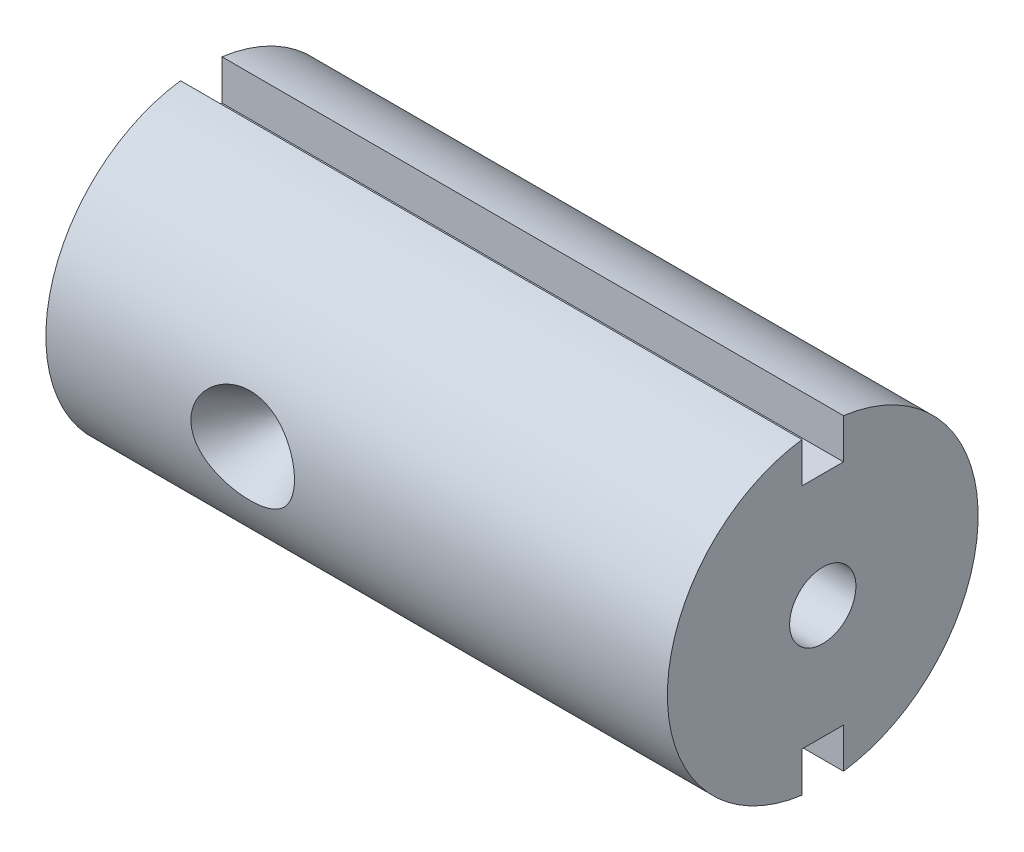
ISO-10303-21;
HEADER;
FILE_DESCRIPTION(('STEP AP214'),'2;1');
FILE_NAME('part.step','',(''),(''),'','','');
FILE_SCHEMA(('AUTOMOTIVE_DESIGN { 1 0 10303 214 1 1 1 1 }'));
ENDSEC;
DATA;
#1=APPLICATION_CONTEXT('core data for automotive mechanical design processes');
#2=APPLICATION_PROTOCOL_DEFINITION('international standard','automotive_design',2000,#1);
#3=PRODUCT_CONTEXT('',#1,'mechanical');
#4=PRODUCT('Part','Part','',(#3));
#5=PRODUCT_RELATED_PRODUCT_CATEGORY('part','',(#4));
#6=PRODUCT_DEFINITION_FORMATION('','',#4);
#7=PRODUCT_DEFINITION_CONTEXT('part definition',#1,'design');
#8=PRODUCT_DEFINITION('design','',#6,#7);
#9=PRODUCT_DEFINITION_SHAPE('','',#8);
#10=(LENGTH_UNIT() NAMED_UNIT(*) SI_UNIT(.MILLI.,.METRE.));
#11=(NAMED_UNIT(*) PLANE_ANGLE_UNIT() SI_UNIT($,.RADIAN.));
#12=(NAMED_UNIT(*) SI_UNIT($,.STERADIAN.) SOLID_ANGLE_UNIT());
#13=UNCERTAINTY_MEASURE_WITH_UNIT(LENGTH_MEASURE(1.E-05),#10,'distance_accuracy_value','');
#14=(GEOMETRIC_REPRESENTATION_CONTEXT(3) GLOBAL_UNCERTAINTY_ASSIGNED_CONTEXT((#13)) GLOBAL_UNIT_ASSIGNED_CONTEXT((#10,
#11,#12)) REPRESENTATION_CONTEXT('',''));
#15=CARTESIAN_POINT('',(0.,0.,0.));
#16=DIRECTION('',(0.,0.,1.));
#17=DIRECTION('',(1.,0.,0.));
#18=AXIS2_PLACEMENT_3D('',#15,#16,#17);
#19=CARTESIAN_POINT('',(30.,0.,0.));
#20=DIRECTION('',(-1.,0.,0.));
#21=DIRECTION('',(0.,0.,1.));
#22=AXIS2_PLACEMENT_3D('',#19,#20,#21);
#23=CYLINDRICAL_SURFACE('',#22,7.5);
#24=CARTESIAN_POINT('',(8.05167576643388,-1.8678339095159,7.2636903168473));
#25=CARTESIAN_POINT('',(7.94089384267672,-1.79551979116087,7.28228452229218));
#26=CARTESIAN_POINT('',(7.83594834377855,-1.71454184921139,7.3019635860243));
#27=CARTESIAN_POINT('',(7.64064186116554,-1.53652103246427,7.34148512460798));
#28=CARTESIAN_POINT('',(7.55028270935543,-1.43947614290813,7.36132761965653));
#29=CARTESIAN_POINT('',(7.38387524010526,-1.22677443180059,7.39980801053964));
#30=CARTESIAN_POINT('',(7.30857195987766,-1.11051452676328,7.41836232759838));
#31=CARTESIAN_POINT('',(7.18073046184307,-0.865486083990146,7.45091545237177));
#32=CARTESIAN_POINT('',(7.12817620389597,-0.736726438395548,7.46491746813526));
#33=CARTESIAN_POINT('',(7.05285690116359,-0.484404625545233,7.48530052112564));
#34=CARTESIAN_POINT('',(7.02761908946084,-0.361631166386663,7.49230848320894));
#35=CARTESIAN_POINT('',(6.99935923763121,-0.113383751305522,7.50016832600957));
#36=CARTESIAN_POINT('',(6.99632372639625,0.0120885207662788,7.50102393962085));
#37=CARTESIAN_POINT('',(7.01193598553265,0.251181951463353,7.49666877916093));
#38=CARTESIAN_POINT('',(7.0288279924378,0.364931988878639,7.49194917688945));
#39=CARTESIAN_POINT('',(7.08062380974595,0.58792444391891,7.47775571735527));
#40=CARTESIAN_POINT('',(7.11552826539031,0.697166699914885,7.46828168978003));
#41=CARTESIAN_POINT('',(7.20240916959938,0.909807532075697,7.44539110102609));
#42=CARTESIAN_POINT('',(7.25459951137338,1.01311282794113,7.43192537826443));
#43=CARTESIAN_POINT('',(7.37398000201785,1.21022391244733,7.40238531524525));
#44=CARTESIAN_POINT('',(7.44117492959094,1.30402666082396,7.3863101443697));
#45=CARTESIAN_POINT('',(7.59509516254294,1.48845167918439,7.35146887044087));
#46=CARTESIAN_POINT('',(7.68302787117252,1.57804405578019,7.33259063916497));
#47=CARTESIAN_POINT('',(7.87166623642185,1.74267846479196,7.2952185595908));
#48=CARTESIAN_POINT('',(7.97237762536778,1.81771392875271,7.27672488816062));
#49=CARTESIAN_POINT('',(8.19445831061447,1.95873731062884,7.2401089630666));
#50=CARTESIAN_POINT('',(8.31688475368407,2.02312038196357,7.22220030887429));
#51=CARTESIAN_POINT('',(8.57084608930949,2.13191681110655,7.19083774467195));
#52=CARTESIAN_POINT('',(8.7023829550377,2.1763258271467,7.17738480336931));
#53=CARTESIAN_POINT('',(8.97743968468817,2.24591331074875,7.15592624277002));
#54=CARTESIAN_POINT('',(9.12123238558421,2.27010601894585,7.14820172669417));
#55=CARTESIAN_POINT('',(9.41103637247809,2.29515403183163,7.14019918694196));
#56=CARTESIAN_POINT('',(9.55704766550141,2.29600926260355,7.13992118685094));
#57=CARTESIAN_POINT('',(9.84729204256608,2.27435549490544,7.14684772622238));
#58=CARTESIAN_POINT('',(9.99152323160554,2.25182346145707,7.15405964278375));
#59=CARTESIAN_POINT('',(10.2740005824609,2.18386501275763,7.17509482599233));
#60=CARTESIAN_POINT('',(10.4122459392935,2.13843552854429,7.1889189788698));
#61=CARTESIAN_POINT('',(10.6791039323375,2.02550924289219,7.22154818550873));
#62=CARTESIAN_POINT('',(10.8076975501141,1.95797020955479,7.24036275841835));
#63=CARTESIAN_POINT('',(11.0511945289785,1.80210416414523,7.28071986992329));
#64=CARTESIAN_POINT('',(11.1660961235601,1.71377447408558,7.30226275978036));
#65=CARTESIAN_POINT('',(11.376720508024,1.51950300546134,7.34512334142966));
#66=CARTESIAN_POINT('',(11.4727086012374,1.41384976851686,7.36643946984713));
#67=CARTESIAN_POINT('',(11.6437558639087,1.18631512488658,7.40647976096864));
#68=CARTESIAN_POINT('',(11.7188286311231,1.06444433829816,7.42520560369803));
#69=CARTESIAN_POINT('',(11.8390792187722,0.818457685144129,7.45615166506275));
#70=CARTESIAN_POINT('',(11.8862071316719,0.695349803365731,7.46878011506183));
#71=CARTESIAN_POINT('',(11.9570715670546,0.442148625658909,7.4880276141246));
#72=CARTESIAN_POINT('',(11.9808288878273,0.312061649605022,7.49465200599139));
#73=CARTESIAN_POINT('',(12.002354764927,0.0634048661109276,7.50065416285993));
#74=CARTESIAN_POINT('',(12.0025898586507,-0.0549403047615223,7.50071968982459));
#75=CARTESIAN_POINT('',(11.9832144135466,-0.28984888948782,7.49531713380502));
#76=CARTESIAN_POINT('',(11.9636072482175,-0.406412602798082,7.48984999146237));
#77=CARTESIAN_POINT('',(11.9064622917801,-0.630707021684352,7.4742535387995));
#78=CARTESIAN_POINT('',(11.8695151895755,-0.7386007922798,7.46427818837703));
#79=CARTESIAN_POINT('',(11.7794930391153,-0.94698639708331,7.44071412409292));
#80=CARTESIAN_POINT('',(11.7264147155406,-1.04747672292655,7.42712467648702));
#81=CARTESIAN_POINT('',(11.6022183464845,-1.24509275286741,7.39664553195232));
#82=CARTESIAN_POINT('',(11.5301790383081,-1.34161406592102,7.37960249638282));
#83=CARTESIAN_POINT('',(11.372324159744,-1.52240502772114,7.34443888656984));
#84=CARTESIAN_POINT('',(11.2865026901591,-1.60666940054624,7.32631785300985));
#85=CARTESIAN_POINT('',(11.0938852956575,-1.76972984723335,7.28874279140795));
#86=CARTESIAN_POINT('',(10.9858386595661,-1.84706298687837,7.26934431491299));
#87=CARTESIAN_POINT('',(10.7586851111909,-1.98408952092731,7.23314755617545));
#88=CARTESIAN_POINT('',(10.6395742434166,-2.04377657466728,7.21635020961148));
#89=CARTESIAN_POINT('',(10.3841771657892,-2.14823217307837,7.18597878097804));
#90=CARTESIAN_POINT('',(10.2472719470952,-2.19158872302593,7.17273068026494));
#91=CARTESIAN_POINT('',(9.96785105658163,-2.25596853847842,7.15274433593004));
#92=CARTESIAN_POINT('',(9.82533506405638,-2.27699052543662,7.1460064649897));
#93=CARTESIAN_POINT('',(9.53644227558881,-2.29638299613897,7.13979959879468));
#94=CARTESIAN_POINT('',(9.39003966409248,-2.29440731148271,7.14044168726841));
#95=CARTESIAN_POINT('',(9.09966976228018,-2.26700548189143,7.14918788554491));
#96=CARTESIAN_POINT('',(8.95570252058019,-2.24157886937943,7.15729214413235));
#97=CARTESIAN_POINT('',(8.67940692503231,-2.16919786502499,7.17955032474397));
#98=CARTESIAN_POINT('',(8.54684583495133,-2.12305743289408,7.19347424995065));
#99=CARTESIAN_POINT('',(8.29126242241162,-2.01041738691509,7.2257624124832));
#100=CARTESIAN_POINT('',(8.16823838647997,-1.94392144091013,7.24412584973187));
#101=CARTESIAN_POINT('',(8.05167576643388,-1.8678339095159,7.2636903168473));
#102=B_SPLINE_CURVE_WITH_KNOTS('',3,(#24,#25,#26,#27,#28,#29,#30,#31,#32,#33,#34,#35,#36,#37,
#38,#39,#40,#41,#42,#43,#44,#45,#46,#47,#48,#49,#50,#51,#52,#53,#54,#55,#56,#57,#58,#59,#60,#61,
#62,#63,#64,#65,#66,#67,#68,#69,#70,#71,#72,#73,#74,#75,#76,#77,#78,#79,#80,#81,#82,#83,#84,#85,
#86,#87,#88,#89,#90,#91,#92,#93,#94,#95,#96,#97,#98,#99,#100,#101),.UNSPECIFIED.,.T.,.F.,(4,2,2,
2,2,2,2,2,2,2,2,2,2,2,2,2,2,2,2,2,2,2,2,2,2,2,2,2,2,2,2,2,2,2,2,2,2,2,4),(0.,0.400348830519514,
0.800747901944159,1.21768115735281,1.6343199559458,2.00887470738987,2.38320218119541,
2.72686757518835,3.0705452808068,3.41864522871087,3.76685619898675,4.14612479038364,
4.52556412154486,4.94214930326349,5.35882499455208,5.79479608699597,6.23076856029051,
6.66717084678287,7.10363164015684,7.54093103875108,7.97828679553669,8.4089854763123,
8.83940348847229,9.23444156875169,9.62912777222159,9.98237866042114,10.335569500453,
10.6775165798378,11.0195331353552,11.3829592463261,11.7465413317294,12.1476636925128,
12.5489300115362,12.979571438792,13.4102375168783,13.8473943995312,14.2845599986374,
14.7058752480843,15.1271146257289),.UNSPECIFIED.);
#103=CARTESIAN_POINT('',(8.05167576643388,-1.8678339095159,7.2636903168473));
#104=VERTEX_POINT('',#103);
#105=EDGE_CURVE('E169',#104,#104,#102,.T.);
#106=ORIENTED_EDGE('',*,*,#105,.T.);
#107=EDGE_LOOP('',(#106));
#108=FACE_BOUND('',#107,.T.);
#109=CARTESIAN_POINT('',(0.,0.,0.));
#110=DIRECTION('',(1.,0.,0.));
#111=DIRECTION('',(0.,0.,-1.));
#112=AXIS2_PLACEMENT_3D('',#109,#110,#111);
#113=CIRCLE('',#112,7.5);
#114=CARTESIAN_POINT('',(0.,7.43303437365926,0.999999999999948));
#115=VERTEX_POINT('',#114);
#116=CARTESIAN_POINT('',(0.,-7.43303437365925,1.));
#117=VERTEX_POINT('',#116);
#118=EDGE_CURVE('E166',#115,#117,#113,.T.);
#119=ORIENTED_EDGE('',*,*,#118,.T.);
#120=DIRECTION('',(-1.,0.,0.));
#121=VECTOR('',#120,1.);
#122=CARTESIAN_POINT('',(30.,-7.43303437365925,1.));
#123=LINE('',#122,#121);
#124=CARTESIAN_POINT('',(30.,-7.43303437365925,1.));
#125=VERTEX_POINT('',#124);
#126=EDGE_CURVE('E116',#117,#125,#123,.F.);
#127=ORIENTED_EDGE('',*,*,#126,.T.);
#128=CARTESIAN_POINT('',(30.,0.,0.));
#129=DIRECTION('',(1.,0.,0.));
#130=DIRECTION('',(0.,0.,-1.));
#131=AXIS2_PLACEMENT_3D('',#128,#129,#130);
#132=CIRCLE('',#131,7.5);
#133=CARTESIAN_POINT('',(30.,7.43303437365926,0.999999999999948));
#134=VERTEX_POINT('',#133);
#135=EDGE_CURVE('E165',#134,#125,#132,.T.);
#136=ORIENTED_EDGE('',*,*,#135,.F.);
#137=DIRECTION('',(-1.,0.,0.));
#138=VECTOR('',#137,1.);
#139=CARTESIAN_POINT('',(30.,7.43303437365926,0.999999999999948));
#140=LINE('',#139,#138);
#141=EDGE_CURVE('E109',#134,#115,#140,.T.);
#142=ORIENTED_EDGE('',*,*,#141,.T.);
#143=EDGE_LOOP('',(#119,#127,#136,#142));
#144=FACE_BOUND('',#143,.T.);
#145=ADVANCED_FACE('F33',(#108,#144),#23,.T.);
#146=CARTESIAN_POINT('',(30.,-7.43303437365925,-1.));
#147=VERTEX_POINT('',#146);
#148=CARTESIAN_POINT('',(30.,7.43303437365925,-1.00000000000005));
#149=VERTEX_POINT('',#148);
#150=EDGE_CURVE('E162',#147,#149,#132,.T.);
#151=ORIENTED_EDGE('',*,*,#150,.F.);
#152=DIRECTION('',(-1.,0.,0.));
#153=VECTOR('',#152,1.);
#154=CARTESIAN_POINT('',(30.,-7.43303437365925,-1.));
#155=LINE('',#154,#153);
#156=CARTESIAN_POINT('',(0.,-7.43303437365925,-1.));
#157=VERTEX_POINT('',#156);
#158=EDGE_CURVE('E151',#147,#157,#155,.T.);
#159=ORIENTED_EDGE('',*,*,#158,.T.);
#160=CARTESIAN_POINT('',(0.,7.43303437365925,-1.00000000000005));
#161=VERTEX_POINT('',#160);
#162=EDGE_CURVE('E159',#157,#161,#113,.T.);
#163=ORIENTED_EDGE('',*,*,#162,.T.);
#164=DIRECTION('',(-1.,0.,0.));
#165=VECTOR('',#164,1.);
#166=CARTESIAN_POINT('',(30.,7.43303437365925,-1.00000000000005));
#167=LINE('',#166,#165);
#168=EDGE_CURVE('E148',#161,#149,#167,.F.);
#169=ORIENTED_EDGE('',*,*,#168,.T.);
#170=EDGE_LOOP('',(#151,#159,#163,#169));
#171=FACE_BOUND('',#170,.T.);
#172=ADVANCED_FACE('F35',(#171),#23,.T.);
#173=CARTESIAN_POINT('',(30.,0.,0.));
#174=DIRECTION('',(1.,0.,0.));
#175=DIRECTION('',(0.,0.,-1.));
#176=AXIS2_PLACEMENT_3D('',#173,#174,#175);
#177=PLANE('',#176);
#178=DIRECTION('',(0.,-1.,0.));
#179=VECTOR('',#178,1.);
#180=CARTESIAN_POINT('',(30.,-8.18618350013699,1.));
#181=LINE('',#180,#179);
#182=CARTESIAN_POINT('',(30.,-5.5,1.));
#183=VERTEX_POINT('',#182);
#184=EDGE_CURVE('E126',#183,#125,#181,.T.);
#185=ORIENTED_EDGE('',*,*,#184,.F.);
#186=DIRECTION('',(0.,0.,1.));
#187=VECTOR('',#186,1.);
#188=CARTESIAN_POINT('',(30.,-5.5,1.));
#189=LINE('',#188,#187);
#190=CARTESIAN_POINT('',(30.,-5.5,-1.));
#191=VERTEX_POINT('',#190);
#192=EDGE_CURVE('E106',#191,#183,#189,.T.);
#193=ORIENTED_EDGE('',*,*,#192,.F.);
#194=DIRECTION('',(0.,1.,0.));
#195=VECTOR('',#194,1.);
#196=CARTESIAN_POINT('',(30.,-8.18618350013699,-1.));
#197=LINE('',#196,#195);
#198=EDGE_CURVE('E128',#147,#191,#197,.T.);
#199=ORIENTED_EDGE('',*,*,#198,.F.);
#200=ORIENTED_EDGE('',*,*,#150,.T.);
#201=DIRECTION('',(0.,1.,0.));
#202=VECTOR('',#201,1.);
#203=CARTESIAN_POINT('',(30.,8.18618350013698,-1.00000000000006));
#204=LINE('',#203,#202);
#205=CARTESIAN_POINT('',(30.,5.49999999999999,-1.00000000000004));
#206=VERTEX_POINT('',#205);
#207=EDGE_CURVE('E134',#206,#149,#204,.T.);
#208=ORIENTED_EDGE('',*,*,#207,.F.);
#209=DIRECTION('',(0.,0.,-1.));
#210=VECTOR('',#209,1.);
#211=CARTESIAN_POINT('',(30.,5.49999999999999,-1.00000000000004));
#212=LINE('',#211,#210);
#213=CARTESIAN_POINT('',(30.,5.50000000000001,0.999999999999961));
#214=VERTEX_POINT('',#213);
#215=EDGE_CURVE('E140',#214,#206,#212,.T.);
#216=ORIENTED_EDGE('',*,*,#215,.F.);
#217=DIRECTION('',(0.,-1.,0.));
#218=VECTOR('',#217,1.);
#219=CARTESIAN_POINT('',(30.,8.18618350013699,0.999999999999942));
#220=LINE('',#219,#218);
#221=EDGE_CURVE('E138',#134,#214,#220,.T.);
#222=ORIENTED_EDGE('',*,*,#221,.F.);
#223=ORIENTED_EDGE('',*,*,#135,.T.);
#224=EDGE_LOOP('',(#185,#193,#199,#200,#208,#216,#222,#223));
#225=FACE_BOUND('',#224,.T.);
#226=CARTESIAN_POINT('',(30.,0.,0.));
#227=DIRECTION('',(-1.,0.,0.));
#228=DIRECTION('',(0.,0.,1.));
#229=AXIS2_PLACEMENT_3D('',#226,#227,#228);
#230=CIRCLE('',#229,1.6);
#231=CARTESIAN_POINT('',(30.,0.,1.6));
#232=VERTEX_POINT('',#231);
#233=EDGE_CURVE('E156',#232,#232,#230,.T.);
#234=ORIENTED_EDGE('',*,*,#233,.T.);
#235=EDGE_LOOP('',(#234));
#236=FACE_BOUND('',#235,.T.);
#237=ADVANCED_FACE('F182',(#225,#236),#177,.T.);
#238=CARTESIAN_POINT('',(0.,0.,0.));
#239=DIRECTION('',(1.,0.,0.));
#240=DIRECTION('',(0.,0.,-1.));
#241=AXIS2_PLACEMENT_3D('',#238,#239,#240);
#242=PLANE('',#241);
#243=CARTESIAN_POINT('',(0.,0.,0.));
#244=DIRECTION('',(-1.,0.,0.));
#245=DIRECTION('',(0.,0.,1.));
#246=AXIS2_PLACEMENT_3D('',#243,#244,#245);
#247=CIRCLE('',#246,1.6);
#248=CARTESIAN_POINT('',(0.,0.,1.6));
#249=VERTEX_POINT('',#248);
#250=EDGE_CURVE('E155',#249,#249,#247,.T.);
#251=ORIENTED_EDGE('',*,*,#250,.F.);
#252=EDGE_LOOP('',(#251));
#253=FACE_BOUND('',#252,.T.);
#254=DIRECTION('',(0.,0.,1.));
#255=VECTOR('',#254,1.);
#256=CARTESIAN_POINT('',(0.,-5.5,1.));
#257=LINE('',#256,#255);
#258=CARTESIAN_POINT('',(0.,-5.5,-1.));
#259=VERTEX_POINT('',#258);
#260=CARTESIAN_POINT('',(0.,-5.5,1.));
#261=VERTEX_POINT('',#260);
#262=EDGE_CURVE('E49',#259,#261,#257,.T.);
#263=ORIENTED_EDGE('',*,*,#262,.T.);
#264=DIRECTION('',(0.,-1.,0.));
#265=VECTOR('',#264,1.);
#266=CARTESIAN_POINT('',(0.,-8.18618350013699,1.));
#267=LINE('',#266,#265);
#268=EDGE_CURVE('E113',#261,#117,#267,.T.);
#269=ORIENTED_EDGE('',*,*,#268,.T.);
#270=ORIENTED_EDGE('',*,*,#118,.F.);
#271=DIRECTION('',(0.,-1.,0.));
#272=VECTOR('',#271,1.);
#273=CARTESIAN_POINT('',(0.,0.,1.));
#274=LINE('',#273,#272);
#275=CARTESIAN_POINT('',(0.,5.50000000000001,0.999999999999961));
#276=VERTEX_POINT('',#275);
#277=EDGE_CURVE('E42',#115,#276,#274,.T.);
#278=ORIENTED_EDGE('',*,*,#277,.T.);
#279=DIRECTION('',(0.,0.,-1.));
#280=VECTOR('',#279,1.);
#281=CARTESIAN_POINT('',(0.,5.49999999999999,-1.00000000000004));
#282=LINE('',#281,#280);
#283=CARTESIAN_POINT('',(0.,5.49999999999999,-1.00000000000004));
#284=VERTEX_POINT('',#283);
#285=EDGE_CURVE('E57',#276,#284,#282,.T.);
#286=ORIENTED_EDGE('',*,*,#285,.T.);
#287=DIRECTION('',(0.,1.,0.));
#288=VECTOR('',#287,1.);
#289=CARTESIAN_POINT('',(0.,8.18618350013698,-1.00000000000006));
#290=LINE('',#289,#288);
#291=EDGE_CURVE('E133',#284,#161,#290,.T.);
#292=ORIENTED_EDGE('',*,*,#291,.T.);
#293=ORIENTED_EDGE('',*,*,#162,.F.);
#294=DIRECTION('',(0.,1.,0.));
#295=VECTOR('',#294,1.);
#296=CARTESIAN_POINT('',(0.,0.,-1.));
#297=LINE('',#296,#295);
#298=EDGE_CURVE('E11',#157,#259,#297,.T.);
#299=ORIENTED_EDGE('',*,*,#298,.T.);
#300=EDGE_LOOP('',(#263,#269,#270,#278,#286,#292,#293,#299));
#301=FACE_BOUND('',#300,.T.);
#302=ADVANCED_FACE('F121',(#253,#301),#242,.F.);
#303=CARTESIAN_POINT('',(9.5,0.,7.5));
#304=DIRECTION('',(0.,0.,1.));
#305=DIRECTION('',(1.,0.,0.));
#306=AXIS2_PLACEMENT_3D('',#303,#304,#305);
#307=CONICAL_SURFACE('',#306,2.5,0.523598775598299);
#308=CARTESIAN_POINT('',(9.5,0.,3.16987298107781));
#309=VERTEX_POINT('',#308);
#310=VERTEX_LOOP('',#309);
#311=FACE_BOUND('',#310,.T.);
#312=ORIENTED_EDGE('',*,*,#105,.F.);
#313=EDGE_LOOP('',(#312));
#314=FACE_BOUND('',#313,.T.);
#315=ADVANCED_FACE('F174',(#311,#314),#307,.F.);
#316=CARTESIAN_POINT('',(30.,0.,0.));
#317=DIRECTION('',(-1.,0.,0.));
#318=DIRECTION('',(0.,0.,1.));
#319=AXIS2_PLACEMENT_3D('',#316,#317,#318);
#320=CYLINDRICAL_SURFACE('',#319,1.6);
#321=ORIENTED_EDGE('',*,*,#233,.F.);
#322=EDGE_LOOP('',(#321));
#323=FACE_BOUND('',#322,.T.);
#324=ORIENTED_EDGE('',*,*,#250,.T.);
#325=EDGE_LOOP('',(#324));
#326=FACE_BOUND('',#325,.T.);
#327=ADVANCED_FACE('F179',(#323,#326),#320,.F.);
#328=CARTESIAN_POINT('',(0.,8.18618350013698,-1.00000000000006));
#329=DIRECTION('',(0.,0.,-1.));
#330=DIRECTION('',(0.,1.,0.));
#331=AXIS2_PLACEMENT_3D('',#328,#329,#330);
#332=PLANE('',#331);
#333=ORIENTED_EDGE('',*,*,#291,.F.);
#334=DIRECTION('',(1.,0.,0.));
#335=VECTOR('',#334,1.);
#336=CARTESIAN_POINT('',(0.,5.49999999999999,-1.00000000000004));
#337=LINE('',#336,#335);
#338=EDGE_CURVE('E129',#284,#206,#337,.T.);
#339=ORIENTED_EDGE('',*,*,#338,.T.);
#340=ORIENTED_EDGE('',*,*,#207,.T.);
#341=ORIENTED_EDGE('',*,*,#168,.F.);
#342=EDGE_LOOP('',(#333,#339,#340,#341));
#343=FACE_BOUND('',#342,.T.);
#344=ADVANCED_FACE('F214',(#343),#332,.F.);
#345=CARTESIAN_POINT('',(0.,8.18618350013699,0.999999999999942));
#346=DIRECTION('',(0.,0.,1.));
#347=DIRECTION('',(0.,-1.,0.));
#348=AXIS2_PLACEMENT_3D('',#345,#346,#347);
#349=PLANE('',#348);
#350=ORIENTED_EDGE('',*,*,#221,.T.);
#351=DIRECTION('',(1.,0.,0.));
#352=VECTOR('',#351,1.);
#353=CARTESIAN_POINT('',(0.,5.50000000000001,0.999999999999961));
#354=LINE('',#353,#352);
#355=EDGE_CURVE('E137',#276,#214,#354,.T.);
#356=ORIENTED_EDGE('',*,*,#355,.F.);
#357=ORIENTED_EDGE('',*,*,#277,.F.);
#358=ORIENTED_EDGE('',*,*,#141,.F.);
#359=EDGE_LOOP('',(#350,#356,#357,#358));
#360=FACE_BOUND('',#359,.T.);
#361=ADVANCED_FACE('F204',(#360),#349,.F.);
#362=CARTESIAN_POINT('',(0.,5.49999999999999,-1.00000000000004));
#363=DIRECTION('',(0.,-1.,0.));
#364=DIRECTION('',(0.,0.,-1.));
#365=AXIS2_PLACEMENT_3D('',#362,#363,#364);
#366=PLANE('',#365);
#367=ORIENTED_EDGE('',*,*,#215,.T.);
#368=ORIENTED_EDGE('',*,*,#338,.F.);
#369=ORIENTED_EDGE('',*,*,#285,.F.);
#370=ORIENTED_EDGE('',*,*,#355,.T.);
#371=EDGE_LOOP('',(#367,#368,#369,#370));
#372=FACE_BOUND('',#371,.T.);
#373=ADVANCED_FACE('F207',(#372),#366,.F.);
#374=CARTESIAN_POINT('',(0.,-8.18618350013699,1.));
#375=DIRECTION('',(0.,0.,1.));
#376=DIRECTION('',(1.,0.,0.));
#377=AXIS2_PLACEMENT_3D('',#374,#375,#376);
#378=PLANE('',#377);
#379=ORIENTED_EDGE('',*,*,#268,.F.);
#380=DIRECTION('',(1.,0.,0.));
#381=VECTOR('',#380,1.);
#382=CARTESIAN_POINT('',(0.,-5.5,1.));
#383=LINE('',#382,#381);
#384=EDGE_CURVE('E102',#261,#183,#383,.T.);
#385=ORIENTED_EDGE('',*,*,#384,.T.);
#386=ORIENTED_EDGE('',*,*,#184,.T.);
#387=ORIENTED_EDGE('',*,*,#126,.F.);
#388=EDGE_LOOP('',(#379,#385,#386,#387));
#389=FACE_BOUND('',#388,.T.);
#390=ADVANCED_FACE('F114',(#389),#378,.F.);
#391=CARTESIAN_POINT('',(0.,-8.18618350013699,-1.));
#392=DIRECTION('',(0.,0.,-1.));
#393=DIRECTION('',(-1.,0.,0.));
#394=AXIS2_PLACEMENT_3D('',#391,#392,#393);
#395=PLANE('',#394);
#396=ORIENTED_EDGE('',*,*,#198,.T.);
#397=DIRECTION('',(1.,0.,0.));
#398=VECTOR('',#397,1.);
#399=CARTESIAN_POINT('',(0.,-5.5,-1.));
#400=LINE('',#399,#398);
#401=EDGE_CURVE('E110',#259,#191,#400,.T.);
#402=ORIENTED_EDGE('',*,*,#401,.F.);
#403=ORIENTED_EDGE('',*,*,#298,.F.);
#404=ORIENTED_EDGE('',*,*,#158,.F.);
#405=EDGE_LOOP('',(#396,#402,#403,#404));
#406=FACE_BOUND('',#405,.T.);
#407=ADVANCED_FACE('F216',(#406),#395,.F.);
#408=CARTESIAN_POINT('',(0.,-5.5,1.));
#409=DIRECTION('',(0.,1.,0.));
#410=DIRECTION('',(0.,0.,1.));
#411=AXIS2_PLACEMENT_3D('',#408,#409,#410);
#412=PLANE('',#411);
#413=ORIENTED_EDGE('',*,*,#192,.T.);
#414=ORIENTED_EDGE('',*,*,#384,.F.);
#415=ORIENTED_EDGE('',*,*,#262,.F.);
#416=ORIENTED_EDGE('',*,*,#401,.T.);
#417=EDGE_LOOP('',(#413,#414,#415,#416));
#418=FACE_BOUND('',#417,.T.);
#419=ADVANCED_FACE('F104',(#418),#412,.F.);
#420=CLOSED_SHELL('',(#145,#172,#237,#302,#315,#327,#344,#361,#373,#390,#407,#419));
#421=MANIFOLD_SOLID_BREP('B2',#420);
#422=ADVANCED_BREP_SHAPE_REPRESENTATION('',(#18,#421),#14);
#423=SHAPE_DEFINITION_REPRESENTATION(#9,#422);
ENDSEC;
END-ISO-10303-21;
